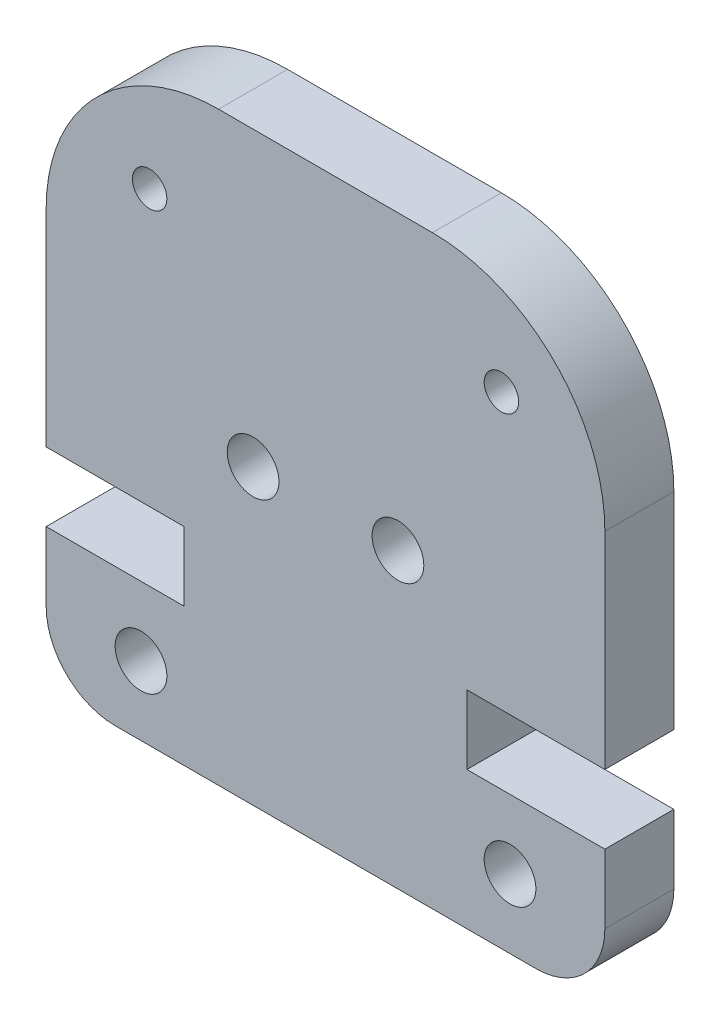
ISO-10303-21;
HEADER;
FILE_DESCRIPTION(('STEP AP214'),'2;1');
FILE_NAME('part.step','',(''),(''),'','','');
FILE_SCHEMA(('AUTOMOTIVE_DESIGN { 1 0 10303 214 1 1 1 1 }'));
ENDSEC;
DATA;
#1=APPLICATION_CONTEXT('core data for automotive mechanical design processes');
#2=APPLICATION_PROTOCOL_DEFINITION('international standard','automotive_design',2000,#1);
#3=PRODUCT_CONTEXT('',#1,'mechanical');
#4=PRODUCT('Part','Part','',(#3));
#5=PRODUCT_RELATED_PRODUCT_CATEGORY('part','',(#4));
#6=PRODUCT_DEFINITION_FORMATION('','',#4);
#7=PRODUCT_DEFINITION_CONTEXT('part definition',#1,'design');
#8=PRODUCT_DEFINITION('design','',#6,#7);
#9=PRODUCT_DEFINITION_SHAPE('','',#8);
#10=(LENGTH_UNIT() NAMED_UNIT(*) SI_UNIT(.MILLI.,.METRE.));
#11=(NAMED_UNIT(*) PLANE_ANGLE_UNIT() SI_UNIT($,.RADIAN.));
#12=(NAMED_UNIT(*) SI_UNIT($,.STERADIAN.) SOLID_ANGLE_UNIT());
#13=UNCERTAINTY_MEASURE_WITH_UNIT(LENGTH_MEASURE(1.E-05),#10,'distance_accuracy_value','');
#14=(GEOMETRIC_REPRESENTATION_CONTEXT(3) GLOBAL_UNCERTAINTY_ASSIGNED_CONTEXT((#13)) GLOBAL_UNIT_ASSIGNED_CONTEXT((#10,
#11,#12)) REPRESENTATION_CONTEXT('',''));
#15=CARTESIAN_POINT('',(0.,0.,0.));
#16=DIRECTION('',(0.,0.,1.));
#17=DIRECTION('',(1.,0.,0.));
#18=AXIS2_PLACEMENT_3D('',#15,#16,#17);
#19=CARTESIAN_POINT('',(-3.09999999999862,11.9799999999986,2.));
#20=DIRECTION('',(0.,0.,-1.));
#21=DIRECTION('',(-1.,0.,0.));
#22=AXIS2_PLACEMENT_3D('',#19,#20,#21);
#23=PLANE('',#22);
#24=CARTESIAN_POINT('',(5.09999999999843,13.9799999999999,2.));
#25=DIRECTION('',(0.,0.,1.));
#26=DIRECTION('',(1.,0.,0.));
#27=AXIS2_PLACEMENT_3D('',#24,#25,#26);
#28=CIRCLE('',#27,0.500000000000168);
#29=CARTESIAN_POINT('',(5.59999999999859,13.9799999999999,2.));
#30=VERTEX_POINT('',#29);
#31=EDGE_CURVE('E352',#30,#30,#28,.T.);
#32=ORIENTED_EDGE('',*,*,#31,.F.);
#33=EDGE_LOOP('',(#32));
#34=FACE_BOUND('',#33,.T.);
#35=CARTESIAN_POINT('',(-2.0999999999983,8.50000000000221,2.));
#36=DIRECTION('',(0.,0.,1.));
#37=DIRECTION('',(-1.,0.,0.));
#38=AXIS2_PLACEMENT_3D('',#35,#36,#37);
#39=CIRCLE('',#38,0.750000000000001);
#40=CARTESIAN_POINT('',(-2.8499999999983,8.50000000000221,2.));
#41=VERTEX_POINT('',#40);
#42=EDGE_CURVE('E364',#41,#41,#39,.T.);
#43=ORIENTED_EDGE('',*,*,#42,.F.);
#44=EDGE_LOOP('',(#43));
#45=FACE_BOUND('',#44,.T.);
#46=CARTESIAN_POINT('',(-5.34999999999999,1.99999999999997,2.));
#47=DIRECTION('',(0.,0.,1.));
#48=DIRECTION('',(-1.,0.,0.));
#49=AXIS2_PLACEMENT_3D('',#46,#47,#48);
#50=CIRCLE('',#49,0.750000000000001);
#51=CARTESIAN_POINT('',(-6.1,1.99999999999997,2.));
#52=VERTEX_POINT('',#51);
#53=EDGE_CURVE('E182',#52,#52,#50,.T.);
#54=ORIENTED_EDGE('',*,*,#53,.F.);
#55=EDGE_LOOP('',(#54));
#56=FACE_BOUND('',#55,.T.);
#57=CARTESIAN_POINT('',(-3.09999999999862,11.9799999999986,2.));
#58=DIRECTION('',(0.,0.,1.));
#59=DIRECTION('',(-1.,0.,0.));
#60=AXIS2_PLACEMENT_3D('',#57,#58,#59);
#61=CIRCLE('',#60,5.00000000000136);
#62=CARTESIAN_POINT('',(-3.09999999999862,16.98,2.));
#63=VERTEX_POINT('',#62);
#64=CARTESIAN_POINT('',(-8.09999999999997,11.9799999999986,2.));
#65=VERTEX_POINT('',#64);
#66=EDGE_CURVE('E209',#63,#65,#61,.T.);
#67=ORIENTED_EDGE('',*,*,#66,.T.);
#68=DIRECTION('',(0.,-1.,0.));
#69=VECTOR('',#68,1.);
#70=CARTESIAN_POINT('',(-8.09999999999997,11.9799999999986,2.));
#71=LINE('',#70,#69);
#72=CARTESIAN_POINT('',(-8.09999999999997,5.99999999999993,2.));
#73=VERTEX_POINT('',#72);
#74=EDGE_CURVE('E117',#65,#73,#71,.T.);
#75=ORIENTED_EDGE('',*,*,#74,.T.);
#76=DIRECTION('',(1.,0.,0.));
#77=VECTOR('',#76,1.);
#78=CARTESIAN_POINT('',(-8.09999999999997,5.99999999999993,2.));
#79=LINE('',#78,#77);
#80=CARTESIAN_POINT('',(-4.10000000000002,5.99999999999993,2.));
#81=VERTEX_POINT('',#80);
#82=EDGE_CURVE('E248',#73,#81,#79,.T.);
#83=ORIENTED_EDGE('',*,*,#82,.T.);
#84=DIRECTION('',(0.,-1.,0.));
#85=VECTOR('',#84,1.);
#86=CARTESIAN_POINT('',(-4.10000000000002,5.99999999999993,2.));
#87=LINE('',#86,#85);
#88=CARTESIAN_POINT('',(-4.10000000000002,3.99999999999995,2.));
#89=VERTEX_POINT('',#88);
#90=EDGE_CURVE('E267',#81,#89,#87,.T.);
#91=ORIENTED_EDGE('',*,*,#90,.T.);
#92=DIRECTION('',(-1.,0.,0.));
#93=VECTOR('',#92,1.);
#94=CARTESIAN_POINT('',(-4.10000000000002,3.99999999999995,2.));
#95=LINE('',#94,#93);
#96=CARTESIAN_POINT('',(-8.09999999999997,3.99999999999995,2.));
#97=VERTEX_POINT('',#96);
#98=EDGE_CURVE('E264',#89,#97,#95,.T.);
#99=ORIENTED_EDGE('',*,*,#98,.T.);
#100=DIRECTION('',(0.,-1.,0.));
#101=VECTOR('',#100,1.);
#102=CARTESIAN_POINT('',(-8.09999999999997,1.99999999999997,2.));
#103=LINE('',#102,#101);
#104=CARTESIAN_POINT('',(-8.09999999999997,1.99999999999997,2.));
#105=VERTEX_POINT('',#104);
#106=EDGE_CURVE('E266',#97,#105,#103,.T.);
#107=ORIENTED_EDGE('',*,*,#106,.T.);
#108=CARTESIAN_POINT('',(-6.1,1.99999999999997,2.));
#109=DIRECTION('',(0.,0.,1.));
#110=DIRECTION('',(-1.,0.,0.));
#111=AXIS2_PLACEMENT_3D('',#108,#109,#110);
#112=CIRCLE('',#111,1.99999999999998);
#113=CARTESIAN_POINT('',(-6.09999999999999,0.,2.));
#114=VERTEX_POINT('',#113);
#115=EDGE_CURVE('E269',#105,#114,#112,.T.);
#116=ORIENTED_EDGE('',*,*,#115,.T.);
#117=DIRECTION('',(1.,0.,0.));
#118=VECTOR('',#117,1.);
#119=CARTESIAN_POINT('',(6.1,0.,2.));
#120=LINE('',#119,#118);
#121=CARTESIAN_POINT('',(6.1,0.,2.));
#122=VERTEX_POINT('',#121);
#123=EDGE_CURVE('E275',#114,#122,#120,.T.);
#124=ORIENTED_EDGE('',*,*,#123,.T.);
#125=CARTESIAN_POINT('',(6.1,1.99999999999998,2.));
#126=DIRECTION('',(0.,0.,1.));
#127=DIRECTION('',(1.,0.,0.));
#128=AXIS2_PLACEMENT_3D('',#125,#126,#127);
#129=CIRCLE('',#128,1.99999999999998);
#130=CARTESIAN_POINT('',(8.09999999999997,1.99999999999998,2.));
#131=VERTEX_POINT('',#130);
#132=EDGE_CURVE('E277',#122,#131,#129,.T.);
#133=ORIENTED_EDGE('',*,*,#132,.T.);
#134=DIRECTION('',(0.,1.,0.));
#135=VECTOR('',#134,1.);
#136=CARTESIAN_POINT('',(8.09999999999997,1.99999999999998,2.));
#137=LINE('',#136,#135);
#138=CARTESIAN_POINT('',(8.09999999999997,3.99999999999995,2.));
#139=VERTEX_POINT('',#138);
#140=EDGE_CURVE('E279',#131,#139,#137,.T.);
#141=ORIENTED_EDGE('',*,*,#140,.T.);
#142=DIRECTION('',(-1.,0.,0.));
#143=VECTOR('',#142,1.);
#144=CARTESIAN_POINT('',(4.10000000000002,3.99999999999995,2.));
#145=LINE('',#144,#143);
#146=CARTESIAN_POINT('',(4.10000000000002,3.99999999999995,2.));
#147=VERTEX_POINT('',#146);
#148=EDGE_CURVE('E281',#139,#147,#145,.T.);
#149=ORIENTED_EDGE('',*,*,#148,.T.);
#150=DIRECTION('',(0.,1.,0.));
#151=VECTOR('',#150,1.);
#152=CARTESIAN_POINT('',(4.10000000000002,5.99999999999993,2.));
#153=LINE('',#152,#151);
#154=CARTESIAN_POINT('',(4.10000000000002,5.99999999999993,2.));
#155=VERTEX_POINT('',#154);
#156=EDGE_CURVE('E283',#147,#155,#153,.T.);
#157=ORIENTED_EDGE('',*,*,#156,.T.);
#158=DIRECTION('',(1.,0.,0.));
#159=VECTOR('',#158,1.);
#160=CARTESIAN_POINT('',(8.09999999999997,5.99999999999993,2.));
#161=LINE('',#160,#159);
#162=CARTESIAN_POINT('',(8.09999999999997,5.99999999999993,2.));
#163=VERTEX_POINT('',#162);
#164=EDGE_CURVE('E160',#155,#163,#161,.T.);
#165=ORIENTED_EDGE('',*,*,#164,.T.);
#166=DIRECTION('',(0.,1.,0.));
#167=VECTOR('',#166,1.);
#168=CARTESIAN_POINT('',(8.09999999999997,11.9799999999986,2.));
#169=LINE('',#168,#167);
#170=CARTESIAN_POINT('',(8.09999999999997,11.9799999999986,2.));
#171=VERTEX_POINT('',#170);
#172=EDGE_CURVE('E154',#163,#171,#169,.T.);
#173=ORIENTED_EDGE('',*,*,#172,.T.);
#174=CARTESIAN_POINT('',(3.09999999999862,11.9799999999986,2.));
#175=DIRECTION('',(0.,0.,1.));
#176=DIRECTION('',(1.,0.,0.));
#177=AXIS2_PLACEMENT_3D('',#174,#175,#176);
#178=CIRCLE('',#177,5.00000000000135);
#179=CARTESIAN_POINT('',(3.09999999999862,16.98,2.));
#180=VERTEX_POINT('',#179);
#181=EDGE_CURVE('E158',#171,#180,#178,.T.);
#182=ORIENTED_EDGE('',*,*,#181,.T.);
#183=DIRECTION('',(-1.,0.,0.));
#184=VECTOR('',#183,1.);
#185=CARTESIAN_POINT('',(3.09999999999862,16.98,2.));
#186=LINE('',#185,#184);
#187=EDGE_CURVE('E50',#180,#63,#186,.T.);
#188=ORIENTED_EDGE('',*,*,#187,.T.);
#189=EDGE_LOOP('',(#67,#75,#83,#91,#99,#107,#116,#124,#133,#141,#149,#157,#165,#173,#182,#188));
#190=FACE_BOUND('',#189,.T.);
#191=CARTESIAN_POINT('',(-5.09999999999842,13.9799999999999,2.));
#192=DIRECTION('',(0.,0.,1.));
#193=DIRECTION('',(-1.,0.,0.));
#194=AXIS2_PLACEMENT_3D('',#191,#192,#193);
#195=CIRCLE('',#194,0.500000000000162);
#196=CARTESIAN_POINT('',(-5.59999999999859,13.9799999999999,2.));
#197=VERTEX_POINT('',#196);
#198=EDGE_CURVE('E370',#197,#197,#195,.T.);
#199=ORIENTED_EDGE('',*,*,#198,.F.);
#200=EDGE_LOOP('',(#199));
#201=FACE_BOUND('',#200,.T.);
#202=CARTESIAN_POINT('',(2.0999999999983,8.50000000000221,2.));
#203=DIRECTION('',(0.,0.,1.));
#204=DIRECTION('',(1.,0.,0.));
#205=AXIS2_PLACEMENT_3D('',#202,#203,#204);
#206=CIRCLE('',#205,0.750000000000001);
#207=CARTESIAN_POINT('',(2.8499999999983,8.50000000000221,2.));
#208=VERTEX_POINT('',#207);
#209=EDGE_CURVE('E358',#208,#208,#206,.T.);
#210=ORIENTED_EDGE('',*,*,#209,.F.);
#211=EDGE_LOOP('',(#210));
#212=FACE_BOUND('',#211,.T.);
#213=CARTESIAN_POINT('',(5.35,1.99999999999998,2.));
#214=DIRECTION('',(0.,0.,1.));
#215=DIRECTION('',(1.,0.,0.));
#216=AXIS2_PLACEMENT_3D('',#213,#214,#215);
#217=CIRCLE('',#216,0.750000000000001);
#218=CARTESIAN_POINT('',(6.1,1.99999999999998,2.));
#219=VERTEX_POINT('',#218);
#220=EDGE_CURVE('E343',#219,#219,#217,.T.);
#221=ORIENTED_EDGE('',*,*,#220,.F.);
#222=EDGE_LOOP('',(#221));
#223=FACE_BOUND('',#222,.T.);
#224=ADVANCED_FACE('F33',(#34,#45,#56,#190,#201,#212,#223),#23,.F.);
#225=CARTESIAN_POINT('',(-3.09999999999862,11.9799999999986,0.));
#226=DIRECTION('',(0.,0.,-1.));
#227=DIRECTION('',(-1.,0.,0.));
#228=AXIS2_PLACEMENT_3D('',#225,#226,#227);
#229=PLANE('',#228);
#230=CARTESIAN_POINT('',(5.09999999999843,13.9799999999999,0.));
#231=DIRECTION('',(0.,0.,1.));
#232=DIRECTION('',(1.,0.,0.));
#233=AXIS2_PLACEMENT_3D('',#230,#231,#232);
#234=CIRCLE('',#233,0.500000000000168);
#235=CARTESIAN_POINT('',(5.59999999999859,13.9799999999999,0.));
#236=VERTEX_POINT('',#235);
#237=EDGE_CURVE('E349',#236,#236,#234,.T.);
#238=ORIENTED_EDGE('',*,*,#237,.T.);
#239=EDGE_LOOP('',(#238));
#240=FACE_BOUND('',#239,.T.);
#241=CARTESIAN_POINT('',(-2.0999999999983,8.50000000000221,0.));
#242=DIRECTION('',(0.,0.,1.));
#243=DIRECTION('',(-1.,0.,0.));
#244=AXIS2_PLACEMENT_3D('',#241,#242,#243);
#245=CIRCLE('',#244,0.750000000000001);
#246=CARTESIAN_POINT('',(-2.8499999999983,8.50000000000221,0.));
#247=VERTEX_POINT('',#246);
#248=EDGE_CURVE('E361',#247,#247,#245,.T.);
#249=ORIENTED_EDGE('',*,*,#248,.T.);
#250=EDGE_LOOP('',(#249));
#251=FACE_BOUND('',#250,.T.);
#252=CARTESIAN_POINT('',(-5.34999999999999,1.99999999999997,0.));
#253=DIRECTION('',(0.,0.,1.));
#254=DIRECTION('',(-1.,0.,0.));
#255=AXIS2_PLACEMENT_3D('',#252,#253,#254);
#256=CIRCLE('',#255,0.750000000000001);
#257=CARTESIAN_POINT('',(-6.1,1.99999999999997,0.));
#258=VERTEX_POINT('',#257);
#259=EDGE_CURVE('E373',#258,#258,#256,.T.);
#260=ORIENTED_EDGE('',*,*,#259,.T.);
#261=EDGE_LOOP('',(#260));
#262=FACE_BOUND('',#261,.T.);
#263=CARTESIAN_POINT('',(-3.09999999999862,11.9799999999986,0.));
#264=DIRECTION('',(0.,0.,1.));
#265=DIRECTION('',(-1.,0.,0.));
#266=AXIS2_PLACEMENT_3D('',#263,#264,#265);
#267=CIRCLE('',#266,5.00000000000136);
#268=CARTESIAN_POINT('',(-3.09999999999862,16.98,0.));
#269=VERTEX_POINT('',#268);
#270=CARTESIAN_POINT('',(-8.09999999999997,11.9799999999986,0.));
#271=VERTEX_POINT('',#270);
#272=EDGE_CURVE('E178',#269,#271,#267,.T.);
#273=ORIENTED_EDGE('',*,*,#272,.F.);
#274=DIRECTION('',(-1.,0.,0.));
#275=VECTOR('',#274,1.);
#276=CARTESIAN_POINT('',(3.09999999999862,16.98,0.));
#277=LINE('',#276,#275);
#278=CARTESIAN_POINT('',(3.09999999999862,16.98,0.));
#279=VERTEX_POINT('',#278);
#280=EDGE_CURVE('E109',#279,#269,#277,.T.);
#281=ORIENTED_EDGE('',*,*,#280,.F.);
#282=CARTESIAN_POINT('',(3.09999999999862,11.9799999999986,0.));
#283=DIRECTION('',(0.,0.,1.));
#284=DIRECTION('',(1.,0.,0.));
#285=AXIS2_PLACEMENT_3D('',#282,#283,#284);
#286=CIRCLE('',#285,5.00000000000135);
#287=CARTESIAN_POINT('',(8.09999999999997,11.9799999999986,0.));
#288=VERTEX_POINT('',#287);
#289=EDGE_CURVE('E103',#288,#279,#286,.T.);
#290=ORIENTED_EDGE('',*,*,#289,.F.);
#291=DIRECTION('',(0.,1.,0.));
#292=VECTOR('',#291,1.);
#293=CARTESIAN_POINT('',(8.09999999999997,11.9799999999986,0.));
#294=LINE('',#293,#292);
#295=CARTESIAN_POINT('',(8.09999999999997,5.99999999999993,0.));
#296=VERTEX_POINT('',#295);
#297=EDGE_CURVE('E168',#296,#288,#294,.T.);
#298=ORIENTED_EDGE('',*,*,#297,.F.);
#299=DIRECTION('',(1.,0.,0.));
#300=VECTOR('',#299,1.);
#301=CARTESIAN_POINT('',(8.09999999999997,5.99999999999993,0.));
#302=LINE('',#301,#300);
#303=CARTESIAN_POINT('',(4.10000000000002,5.99999999999993,0.));
#304=VERTEX_POINT('',#303);
#305=EDGE_CURVE('E204',#304,#296,#302,.T.);
#306=ORIENTED_EDGE('',*,*,#305,.F.);
#307=DIRECTION('',(0.,1.,0.));
#308=VECTOR('',#307,1.);
#309=CARTESIAN_POINT('',(4.10000000000002,5.99999999999993,0.));
#310=LINE('',#309,#308);
#311=CARTESIAN_POINT('',(4.10000000000002,3.99999999999995,0.));
#312=VERTEX_POINT('',#311);
#313=EDGE_CURVE('E202',#312,#304,#310,.T.);
#314=ORIENTED_EDGE('',*,*,#313,.F.);
#315=DIRECTION('',(-1.,0.,0.));
#316=VECTOR('',#315,1.);
#317=CARTESIAN_POINT('',(4.10000000000002,3.99999999999995,0.));
#318=LINE('',#317,#316);
#319=CARTESIAN_POINT('',(8.09999999999997,3.99999999999995,0.));
#320=VERTEX_POINT('',#319);
#321=EDGE_CURVE('E200',#320,#312,#318,.T.);
#322=ORIENTED_EDGE('',*,*,#321,.F.);
#323=DIRECTION('',(0.,1.,0.));
#324=VECTOR('',#323,1.);
#325=CARTESIAN_POINT('',(8.09999999999997,1.99999999999998,0.));
#326=LINE('',#325,#324);
#327=CARTESIAN_POINT('',(8.09999999999997,1.99999999999998,0.));
#328=VERTEX_POINT('',#327);
#329=EDGE_CURVE('E198',#328,#320,#326,.T.);
#330=ORIENTED_EDGE('',*,*,#329,.F.);
#331=CARTESIAN_POINT('',(6.1,1.99999999999998,0.));
#332=DIRECTION('',(0.,0.,1.));
#333=DIRECTION('',(1.,0.,0.));
#334=AXIS2_PLACEMENT_3D('',#331,#332,#333);
#335=CIRCLE('',#334,1.99999999999998);
#336=CARTESIAN_POINT('',(6.1,0.,0.));
#337=VERTEX_POINT('',#336);
#338=EDGE_CURVE('E196',#337,#328,#335,.T.);
#339=ORIENTED_EDGE('',*,*,#338,.F.);
#340=DIRECTION('',(1.,0.,0.));
#341=VECTOR('',#340,1.);
#342=CARTESIAN_POINT('',(6.1,0.,0.));
#343=LINE('',#342,#341);
#344=CARTESIAN_POINT('',(-6.09999999999999,0.,0.));
#345=VERTEX_POINT('',#344);
#346=EDGE_CURVE('E194',#345,#337,#343,.T.);
#347=ORIENTED_EDGE('',*,*,#346,.F.);
#348=CARTESIAN_POINT('',(-6.1,1.99999999999997,0.));
#349=DIRECTION('',(0.,0.,1.));
#350=DIRECTION('',(-1.,0.,0.));
#351=AXIS2_PLACEMENT_3D('',#348,#349,#350);
#352=CIRCLE('',#351,1.99999999999998);
#353=CARTESIAN_POINT('',(-8.09999999999997,1.99999999999997,0.));
#354=VERTEX_POINT('',#353);
#355=EDGE_CURVE('E192',#354,#345,#352,.T.);
#356=ORIENTED_EDGE('',*,*,#355,.F.);
#357=DIRECTION('',(0.,-1.,0.));
#358=VECTOR('',#357,1.);
#359=CARTESIAN_POINT('',(-8.09999999999997,1.99999999999997,0.));
#360=LINE('',#359,#358);
#361=CARTESIAN_POINT('',(-8.09999999999997,3.99999999999995,0.));
#362=VERTEX_POINT('',#361);
#363=EDGE_CURVE('E190',#362,#354,#360,.T.);
#364=ORIENTED_EDGE('',*,*,#363,.F.);
#365=DIRECTION('',(-1.,0.,0.));
#366=VECTOR('',#365,1.);
#367=CARTESIAN_POINT('',(-4.10000000000002,3.99999999999995,0.));
#368=LINE('',#367,#366);
#369=CARTESIAN_POINT('',(-4.10000000000002,3.99999999999995,0.));
#370=VERTEX_POINT('',#369);
#371=EDGE_CURVE('E188',#370,#362,#368,.T.);
#372=ORIENTED_EDGE('',*,*,#371,.F.);
#373=DIRECTION('',(0.,-1.,0.));
#374=VECTOR('',#373,1.);
#375=CARTESIAN_POINT('',(-4.10000000000002,5.99999999999993,0.));
#376=LINE('',#375,#374);
#377=CARTESIAN_POINT('',(-4.10000000000002,5.99999999999993,0.));
#378=VERTEX_POINT('',#377);
#379=EDGE_CURVE('E186',#378,#370,#376,.T.);
#380=ORIENTED_EDGE('',*,*,#379,.F.);
#381=DIRECTION('',(1.,0.,0.));
#382=VECTOR('',#381,1.);
#383=CARTESIAN_POINT('',(-8.09999999999997,5.99999999999993,0.));
#384=LINE('',#383,#382);
#385=CARTESIAN_POINT('',(-8.09999999999997,5.99999999999993,0.));
#386=VERTEX_POINT('',#385);
#387=EDGE_CURVE('E184',#386,#378,#384,.T.);
#388=ORIENTED_EDGE('',*,*,#387,.F.);
#389=DIRECTION('',(0.,-1.,0.));
#390=VECTOR('',#389,1.);
#391=CARTESIAN_POINT('',(-8.09999999999997,11.9799999999986,0.));
#392=LINE('',#391,#390);
#393=EDGE_CURVE('E181',#271,#386,#392,.T.);
#394=ORIENTED_EDGE('',*,*,#393,.F.);
#395=EDGE_LOOP('',(#273,#281,#290,#298,#306,#314,#322,#330,#339,#347,#356,#364,#372,#380,#388,#394));
#396=FACE_BOUND('',#395,.T.);
#397=CARTESIAN_POINT('',(-5.09999999999842,13.9799999999999,0.));
#398=DIRECTION('',(0.,0.,1.));
#399=DIRECTION('',(-1.,0.,0.));
#400=AXIS2_PLACEMENT_3D('',#397,#398,#399);
#401=CIRCLE('',#400,0.500000000000162);
#402=CARTESIAN_POINT('',(-5.59999999999859,13.9799999999999,0.));
#403=VERTEX_POINT('',#402);
#404=EDGE_CURVE('E367',#403,#403,#401,.T.);
#405=ORIENTED_EDGE('',*,*,#404,.T.);
#406=EDGE_LOOP('',(#405));
#407=FACE_BOUND('',#406,.T.);
#408=CARTESIAN_POINT('',(2.0999999999983,8.50000000000221,0.));
#409=DIRECTION('',(0.,0.,1.));
#410=DIRECTION('',(1.,0.,0.));
#411=AXIS2_PLACEMENT_3D('',#408,#409,#410);
#412=CIRCLE('',#411,0.750000000000001);
#413=CARTESIAN_POINT('',(2.8499999999983,8.50000000000221,0.));
#414=VERTEX_POINT('',#413);
#415=EDGE_CURVE('E355',#414,#414,#412,.T.);
#416=ORIENTED_EDGE('',*,*,#415,.T.);
#417=EDGE_LOOP('',(#416));
#418=FACE_BOUND('',#417,.T.);
#419=CARTESIAN_POINT('',(5.35,1.99999999999998,0.));
#420=DIRECTION('',(0.,0.,1.));
#421=DIRECTION('',(1.,0.,0.));
#422=AXIS2_PLACEMENT_3D('',#419,#420,#421);
#423=CIRCLE('',#422,0.750000000000001);
#424=CARTESIAN_POINT('',(6.1,1.99999999999998,0.));
#425=VERTEX_POINT('',#424);
#426=EDGE_CURVE('E346',#425,#425,#423,.T.);
#427=ORIENTED_EDGE('',*,*,#426,.T.);
#428=EDGE_LOOP('',(#427));
#429=FACE_BOUND('',#428,.T.);
#430=ADVANCED_FACE('F252',(#240,#251,#262,#396,#407,#418,#429),#229,.T.);
#431=CARTESIAN_POINT('',(-3.09999999999862,11.9799999999986,2.));
#432=DIRECTION('',(0.,0.,-1.));
#433=DIRECTION('',(-1.,0.,0.));
#434=AXIS2_PLACEMENT_3D('',#431,#432,#433);
#435=CYLINDRICAL_SURFACE('',#434,5.00000000000136);
#436=ORIENTED_EDGE('',*,*,#272,.T.);
#437=DIRECTION('',(0.,0.,-1.));
#438=VECTOR('',#437,1.);
#439=CARTESIAN_POINT('',(-8.09999999999997,11.9799999999986,2.));
#440=LINE('',#439,#438);
#441=EDGE_CURVE('E11',#65,#271,#440,.T.);
#442=ORIENTED_EDGE('',*,*,#441,.F.);
#443=ORIENTED_EDGE('',*,*,#66,.F.);
#444=DIRECTION('',(0.,0.,-1.));
#445=VECTOR('',#444,1.);
#446=CARTESIAN_POINT('',(-3.09999999999862,16.98,2.));
#447=LINE('',#446,#445);
#448=EDGE_CURVE('E174',#63,#269,#447,.T.);
#449=ORIENTED_EDGE('',*,*,#448,.T.);
#450=EDGE_LOOP('',(#436,#442,#443,#449));
#451=FACE_BOUND('',#450,.T.);
#452=ADVANCED_FACE('F35',(#451),#435,.T.);
#453=CARTESIAN_POINT('',(-8.09999999999997,11.9799999999986,2.));
#454=DIRECTION('',(1.,0.,0.));
#455=DIRECTION('',(0.,1.,0.));
#456=AXIS2_PLACEMENT_3D('',#453,#454,#455);
#457=PLANE('',#456);
#458=ORIENTED_EDGE('',*,*,#393,.T.);
#459=DIRECTION('',(0.,0.,-1.));
#460=VECTOR('',#459,1.);
#461=CARTESIAN_POINT('',(-8.09999999999997,5.99999999999993,2.));
#462=LINE('',#461,#460);
#463=EDGE_CURVE('E42',#73,#386,#462,.T.);
#464=ORIENTED_EDGE('',*,*,#463,.F.);
#465=ORIENTED_EDGE('',*,*,#74,.F.);
#466=ORIENTED_EDGE('',*,*,#441,.T.);
#467=EDGE_LOOP('',(#458,#464,#465,#466));
#468=FACE_BOUND('',#467,.T.);
#469=ADVANCED_FACE('F540',(#468),#457,.F.);
#470=CARTESIAN_POINT('',(-8.09999999999997,5.99999999999993,2.));
#471=DIRECTION('',(0.,1.,0.));
#472=DIRECTION('',(-1.,0.,0.));
#473=AXIS2_PLACEMENT_3D('',#470,#471,#472);
#474=PLANE('',#473);
#475=ORIENTED_EDGE('',*,*,#387,.T.);
#476=DIRECTION('',(0.,0.,-1.));
#477=VECTOR('',#476,1.);
#478=CARTESIAN_POINT('',(-4.10000000000002,5.99999999999993,2.));
#479=LINE('',#478,#477);
#480=EDGE_CURVE('E240',#81,#378,#479,.T.);
#481=ORIENTED_EDGE('',*,*,#480,.F.);
#482=ORIENTED_EDGE('',*,*,#82,.F.);
#483=ORIENTED_EDGE('',*,*,#463,.T.);
#484=EDGE_LOOP('',(#475,#481,#482,#483));
#485=FACE_BOUND('',#484,.T.);
#486=ADVANCED_FACE('F246',(#485),#474,.F.);
#487=CARTESIAN_POINT('',(-4.10000000000002,5.99999999999993,2.));
#488=DIRECTION('',(1.,0.,0.));
#489=DIRECTION('',(0.,0.,-1.));
#490=AXIS2_PLACEMENT_3D('',#487,#488,#489);
#491=PLANE('',#490);
#492=ORIENTED_EDGE('',*,*,#379,.T.);
#493=DIRECTION('',(0.,0.,-1.));
#494=VECTOR('',#493,1.);
#495=CARTESIAN_POINT('',(-4.10000000000002,3.99999999999995,2.));
#496=LINE('',#495,#494);
#497=EDGE_CURVE('E237',#89,#370,#496,.T.);
#498=ORIENTED_EDGE('',*,*,#497,.F.);
#499=ORIENTED_EDGE('',*,*,#90,.F.);
#500=ORIENTED_EDGE('',*,*,#480,.T.);
#501=EDGE_LOOP('',(#492,#498,#499,#500));
#502=FACE_BOUND('',#501,.T.);
#503=ADVANCED_FACE('F258',(#502),#491,.F.);
#504=CARTESIAN_POINT('',(-4.10000000000002,3.99999999999995,2.));
#505=DIRECTION('',(0.,-1.,0.));
#506=DIRECTION('',(1.,0.,0.));
#507=AXIS2_PLACEMENT_3D('',#504,#505,#506);
#508=PLANE('',#507);
#509=ORIENTED_EDGE('',*,*,#371,.T.);
#510=DIRECTION('',(0.,0.,-1.));
#511=VECTOR('',#510,1.);
#512=CARTESIAN_POINT('',(-8.09999999999997,3.99999999999995,2.));
#513=LINE('',#512,#511);
#514=EDGE_CURVE('E234',#97,#362,#513,.T.);
#515=ORIENTED_EDGE('',*,*,#514,.F.);
#516=ORIENTED_EDGE('',*,*,#98,.F.);
#517=ORIENTED_EDGE('',*,*,#497,.T.);
#518=EDGE_LOOP('',(#509,#515,#516,#517));
#519=FACE_BOUND('',#518,.T.);
#520=ADVANCED_FACE('F262',(#519),#508,.F.);
#521=CARTESIAN_POINT('',(-8.09999999999997,1.99999999999997,2.));
#522=DIRECTION('',(1.,0.,0.));
#523=DIRECTION('',(0.,0.,-1.));
#524=AXIS2_PLACEMENT_3D('',#521,#522,#523);
#525=PLANE('',#524);
#526=ORIENTED_EDGE('',*,*,#363,.T.);
#527=DIRECTION('',(0.,0.,-1.));
#528=VECTOR('',#527,1.);
#529=CARTESIAN_POINT('',(-8.09999999999997,1.99999999999997,2.));
#530=LINE('',#529,#528);
#531=EDGE_CURVE('E231',#105,#354,#530,.T.);
#532=ORIENTED_EDGE('',*,*,#531,.F.);
#533=ORIENTED_EDGE('',*,*,#106,.F.);
#534=ORIENTED_EDGE('',*,*,#514,.T.);
#535=EDGE_LOOP('',(#526,#532,#533,#534));
#536=FACE_BOUND('',#535,.T.);
#537=ADVANCED_FACE('F505',(#536),#525,.F.);
#538=CARTESIAN_POINT('',(-6.1,1.99999999999997,2.));
#539=DIRECTION('',(0.,0.,-1.));
#540=DIRECTION('',(-1.,0.,0.));
#541=AXIS2_PLACEMENT_3D('',#538,#539,#540);
#542=CYLINDRICAL_SURFACE('',#541,1.99999999999998);
#543=ORIENTED_EDGE('',*,*,#355,.T.);
#544=DIRECTION('',(0.,0.,-1.));
#545=VECTOR('',#544,1.);
#546=CARTESIAN_POINT('',(-6.09999999999999,0.,2.));
#547=LINE('',#546,#545);
#548=EDGE_CURVE('E228',#114,#345,#547,.T.);
#549=ORIENTED_EDGE('',*,*,#548,.F.);
#550=ORIENTED_EDGE('',*,*,#115,.F.);
#551=ORIENTED_EDGE('',*,*,#531,.T.);
#552=EDGE_LOOP('',(#543,#549,#550,#551));
#553=FACE_BOUND('',#552,.T.);
#554=ADVANCED_FACE('F495',(#553),#542,.T.);
#555=CARTESIAN_POINT('',(6.1,0.,2.));
#556=DIRECTION('',(0.,1.,0.));
#557=DIRECTION('',(-1.,0.,0.));
#558=AXIS2_PLACEMENT_3D('',#555,#556,#557);
#559=PLANE('',#558);
#560=ORIENTED_EDGE('',*,*,#346,.T.);
#561=DIRECTION('',(0.,0.,-1.));
#562=VECTOR('',#561,1.);
#563=CARTESIAN_POINT('',(6.1,0.,2.));
#564=LINE('',#563,#562);
#565=EDGE_CURVE('E225',#122,#337,#564,.T.);
#566=ORIENTED_EDGE('',*,*,#565,.F.);
#567=ORIENTED_EDGE('',*,*,#123,.F.);
#568=ORIENTED_EDGE('',*,*,#548,.T.);
#569=EDGE_LOOP('',(#560,#566,#567,#568));
#570=FACE_BOUND('',#569,.T.);
#571=ADVANCED_FACE('F485',(#570),#559,.F.);
#572=CARTESIAN_POINT('',(6.1,1.99999999999998,2.));
#573=DIRECTION('',(0.,0.,-1.));
#574=DIRECTION('',(-1.,0.,0.));
#575=AXIS2_PLACEMENT_3D('',#572,#573,#574);
#576=CYLINDRICAL_SURFACE('',#575,1.99999999999998);
#577=ORIENTED_EDGE('',*,*,#338,.T.);
#578=DIRECTION('',(0.,0.,-1.));
#579=VECTOR('',#578,1.);
#580=CARTESIAN_POINT('',(8.09999999999997,1.99999999999998,2.));
#581=LINE('',#580,#579);
#582=EDGE_CURVE('E222',#131,#328,#581,.T.);
#583=ORIENTED_EDGE('',*,*,#582,.F.);
#584=ORIENTED_EDGE('',*,*,#132,.F.);
#585=ORIENTED_EDGE('',*,*,#565,.T.);
#586=EDGE_LOOP('',(#577,#583,#584,#585));
#587=FACE_BOUND('',#586,.T.);
#588=ADVANCED_FACE('F475',(#587),#576,.T.);
#589=CARTESIAN_POINT('',(8.09999999999997,1.99999999999998,2.));
#590=DIRECTION('',(-1.,0.,0.));
#591=DIRECTION('',(0.,0.,1.));
#592=AXIS2_PLACEMENT_3D('',#589,#590,#591);
#593=PLANE('',#592);
#594=ORIENTED_EDGE('',*,*,#329,.T.);
#595=DIRECTION('',(0.,0.,-1.));
#596=VECTOR('',#595,1.);
#597=CARTESIAN_POINT('',(8.09999999999997,3.99999999999995,2.));
#598=LINE('',#597,#596);
#599=EDGE_CURVE('E219',#139,#320,#598,.T.);
#600=ORIENTED_EDGE('',*,*,#599,.F.);
#601=ORIENTED_EDGE('',*,*,#140,.F.);
#602=ORIENTED_EDGE('',*,*,#582,.T.);
#603=EDGE_LOOP('',(#594,#600,#601,#602));
#604=FACE_BOUND('',#603,.T.);
#605=ADVANCED_FACE('F465',(#604),#593,.F.);
#606=CARTESIAN_POINT('',(4.10000000000002,3.99999999999995,2.));
#607=DIRECTION('',(0.,-1.,0.));
#608=DIRECTION('',(0.,0.,-1.));
#609=AXIS2_PLACEMENT_3D('',#606,#607,#608);
#610=PLANE('',#609);
#611=ORIENTED_EDGE('',*,*,#321,.T.);
#612=DIRECTION('',(0.,0.,-1.));
#613=VECTOR('',#612,1.);
#614=CARTESIAN_POINT('',(4.10000000000002,3.99999999999995,2.));
#615=LINE('',#614,#613);
#616=EDGE_CURVE('E216',#147,#312,#615,.T.);
#617=ORIENTED_EDGE('',*,*,#616,.F.);
#618=ORIENTED_EDGE('',*,*,#148,.F.);
#619=ORIENTED_EDGE('',*,*,#599,.T.);
#620=EDGE_LOOP('',(#611,#617,#618,#619));
#621=FACE_BOUND('',#620,.T.);
#622=ADVANCED_FACE('F456',(#621),#610,.F.);
#623=CARTESIAN_POINT('',(4.10000000000002,5.99999999999993,2.));
#624=DIRECTION('',(-1.,0.,0.));
#625=DIRECTION('',(0.,0.,1.));
#626=AXIS2_PLACEMENT_3D('',#623,#624,#625);
#627=PLANE('',#626);
#628=ORIENTED_EDGE('',*,*,#313,.T.);
#629=DIRECTION('',(0.,0.,-1.));
#630=VECTOR('',#629,1.);
#631=CARTESIAN_POINT('',(4.10000000000002,5.99999999999993,2.));
#632=LINE('',#631,#630);
#633=EDGE_CURVE('E213',#155,#304,#632,.T.);
#634=ORIENTED_EDGE('',*,*,#633,.F.);
#635=ORIENTED_EDGE('',*,*,#156,.F.);
#636=ORIENTED_EDGE('',*,*,#616,.T.);
#637=EDGE_LOOP('',(#628,#634,#635,#636));
#638=FACE_BOUND('',#637,.T.);
#639=ADVANCED_FACE('F289',(#638),#627,.F.);
#640=CARTESIAN_POINT('',(8.09999999999997,5.99999999999993,2.));
#641=DIRECTION('',(0.,1.,0.));
#642=DIRECTION('',(0.,0.,1.));
#643=AXIS2_PLACEMENT_3D('',#640,#641,#642);
#644=PLANE('',#643);
#645=ORIENTED_EDGE('',*,*,#305,.T.);
#646=DIRECTION('',(0.,0.,-1.));
#647=VECTOR('',#646,1.);
#648=CARTESIAN_POINT('',(8.09999999999997,5.99999999999993,2.));
#649=LINE('',#648,#647);
#650=EDGE_CURVE('E169',#163,#296,#649,.T.);
#651=ORIENTED_EDGE('',*,*,#650,.F.);
#652=ORIENTED_EDGE('',*,*,#164,.F.);
#653=ORIENTED_EDGE('',*,*,#633,.T.);
#654=EDGE_LOOP('',(#645,#651,#652,#653));
#655=FACE_BOUND('',#654,.T.);
#656=ADVANCED_FACE('F293',(#655),#644,.F.);
#657=CARTESIAN_POINT('',(8.09999999999997,11.9799999999986,2.));
#658=DIRECTION('',(-1.,0.,0.));
#659=DIRECTION('',(0.,0.,1.));
#660=AXIS2_PLACEMENT_3D('',#657,#658,#659);
#661=PLANE('',#660);
#662=ORIENTED_EDGE('',*,*,#297,.T.);
#663=DIRECTION('',(0.,0.,-1.));
#664=VECTOR('',#663,1.);
#665=CARTESIAN_POINT('',(8.09999999999997,11.9799999999986,2.));
#666=LINE('',#665,#664);
#667=EDGE_CURVE('E165',#171,#288,#666,.T.);
#668=ORIENTED_EDGE('',*,*,#667,.F.);
#669=ORIENTED_EDGE('',*,*,#172,.F.);
#670=ORIENTED_EDGE('',*,*,#650,.T.);
#671=EDGE_LOOP('',(#662,#668,#669,#670));
#672=FACE_BOUND('',#671,.T.);
#673=ADVANCED_FACE('F166',(#672),#661,.F.);
#674=CARTESIAN_POINT('',(3.09999999999862,11.9799999999986,2.));
#675=DIRECTION('',(0.,0.,-1.));
#676=DIRECTION('',(-1.,0.,0.));
#677=AXIS2_PLACEMENT_3D('',#674,#675,#676);
#678=CYLINDRICAL_SURFACE('',#677,5.00000000000135);
#679=ORIENTED_EDGE('',*,*,#289,.T.);
#680=DIRECTION('',(0.,0.,-1.));
#681=VECTOR('',#680,1.);
#682=CARTESIAN_POINT('',(3.09999999999862,16.98,2.));
#683=LINE('',#682,#681);
#684=EDGE_CURVE('E170',#180,#279,#683,.T.);
#685=ORIENTED_EDGE('',*,*,#684,.F.);
#686=ORIENTED_EDGE('',*,*,#181,.F.);
#687=ORIENTED_EDGE('',*,*,#667,.T.);
#688=EDGE_LOOP('',(#679,#685,#686,#687));
#689=FACE_BOUND('',#688,.T.);
#690=ADVANCED_FACE('F172',(#689),#678,.T.);
#691=CARTESIAN_POINT('',(3.09999999999862,16.98,2.));
#692=DIRECTION('',(0.,-1.,0.));
#693=DIRECTION('',(0.,0.,-1.));
#694=AXIS2_PLACEMENT_3D('',#691,#692,#693);
#695=PLANE('',#694);
#696=ORIENTED_EDGE('',*,*,#280,.T.);
#697=ORIENTED_EDGE('',*,*,#448,.F.);
#698=ORIENTED_EDGE('',*,*,#187,.F.);
#699=ORIENTED_EDGE('',*,*,#684,.T.);
#700=EDGE_LOOP('',(#696,#697,#698,#699));
#701=FACE_BOUND('',#700,.T.);
#702=ADVANCED_FACE('F297',(#701),#695,.F.);
#703=CARTESIAN_POINT('',(-5.34999999999999,1.99999999999997,2.));
#704=DIRECTION('',(0.,0.,-1.));
#705=DIRECTION('',(-1.,0.,0.));
#706=AXIS2_PLACEMENT_3D('',#703,#704,#705);
#707=CYLINDRICAL_SURFACE('',#706,0.750000000000001);
#708=ORIENTED_EDGE('',*,*,#53,.T.);
#709=EDGE_LOOP('',(#708));
#710=FACE_BOUND('',#709,.T.);
#711=ORIENTED_EDGE('',*,*,#259,.F.);
#712=EDGE_LOOP('',(#711));
#713=FACE_BOUND('',#712,.T.);
#714=ADVANCED_FACE('F299',(#710,#713),#707,.F.);
#715=CARTESIAN_POINT('',(-5.09999999999842,13.9799999999999,2.));
#716=DIRECTION('',(0.,0.,-1.));
#717=DIRECTION('',(-1.,0.,0.));
#718=AXIS2_PLACEMENT_3D('',#715,#716,#717);
#719=CYLINDRICAL_SURFACE('',#718,0.500000000000162);
#720=ORIENTED_EDGE('',*,*,#198,.T.);
#721=EDGE_LOOP('',(#720));
#722=FACE_BOUND('',#721,.T.);
#723=ORIENTED_EDGE('',*,*,#404,.F.);
#724=EDGE_LOOP('',(#723));
#725=FACE_BOUND('',#724,.T.);
#726=ADVANCED_FACE('F305',(#722,#725),#719,.F.);
#727=CARTESIAN_POINT('',(-2.0999999999983,8.50000000000221,2.));
#728=DIRECTION('',(0.,0.,-1.));
#729=DIRECTION('',(-1.,0.,0.));
#730=AXIS2_PLACEMENT_3D('',#727,#728,#729);
#731=CYLINDRICAL_SURFACE('',#730,0.750000000000001);
#732=ORIENTED_EDGE('',*,*,#42,.T.);
#733=EDGE_LOOP('',(#732));
#734=FACE_BOUND('',#733,.T.);
#735=ORIENTED_EDGE('',*,*,#248,.F.);
#736=EDGE_LOOP('',(#735));
#737=FACE_BOUND('',#736,.T.);
#738=ADVANCED_FACE('F322',(#734,#737),#731,.F.);
#739=CARTESIAN_POINT('',(2.0999999999983,8.50000000000221,2.));
#740=DIRECTION('',(0.,0.,-1.));
#741=DIRECTION('',(-1.,0.,0.));
#742=AXIS2_PLACEMENT_3D('',#739,#740,#741);
#743=CYLINDRICAL_SURFACE('',#742,0.750000000000001);
#744=ORIENTED_EDGE('',*,*,#209,.T.);
#745=EDGE_LOOP('',(#744));
#746=FACE_BOUND('',#745,.T.);
#747=ORIENTED_EDGE('',*,*,#415,.F.);
#748=EDGE_LOOP('',(#747));
#749=FACE_BOUND('',#748,.T.);
#750=ADVANCED_FACE('F326',(#746,#749),#743,.F.);
#751=CARTESIAN_POINT('',(5.09999999999843,13.9799999999999,2.));
#752=DIRECTION('',(0.,0.,-1.));
#753=DIRECTION('',(-1.,0.,0.));
#754=AXIS2_PLACEMENT_3D('',#751,#752,#753);
#755=CYLINDRICAL_SURFACE('',#754,0.500000000000168);
#756=ORIENTED_EDGE('',*,*,#31,.T.);
#757=EDGE_LOOP('',(#756));
#758=FACE_BOUND('',#757,.T.);
#759=ORIENTED_EDGE('',*,*,#237,.F.);
#760=EDGE_LOOP('',(#759));
#761=FACE_BOUND('',#760,.T.);
#762=ADVANCED_FACE('F330',(#758,#761),#755,.F.);
#763=CARTESIAN_POINT('',(5.35,1.99999999999998,2.));
#764=DIRECTION('',(0.,0.,-1.));
#765=DIRECTION('',(-1.,0.,0.));
#766=AXIS2_PLACEMENT_3D('',#763,#764,#765);
#767=CYLINDRICAL_SURFACE('',#766,0.750000000000001);
#768=ORIENTED_EDGE('',*,*,#220,.T.);
#769=EDGE_LOOP('',(#768));
#770=FACE_BOUND('',#769,.T.);
#771=ORIENTED_EDGE('',*,*,#426,.F.);
#772=EDGE_LOOP('',(#771));
#773=FACE_BOUND('',#772,.T.);
#774=ADVANCED_FACE('F334',(#770,#773),#767,.F.);
#775=CLOSED_SHELL('',(#224,#430,#452,#469,#486,#503,#520,#537,#554,#571,#588,#605,#622,#639,
#656,#673,#690,#702,#714,#726,#738,#750,#762,#774));
#776=MANIFOLD_SOLID_BREP('B2',#775);
#777=ADVANCED_BREP_SHAPE_REPRESENTATION('',(#18,#776),#14);
#778=SHAPE_DEFINITION_REPRESENTATION(#9,#777);
ENDSEC;
END-ISO-10303-21;
